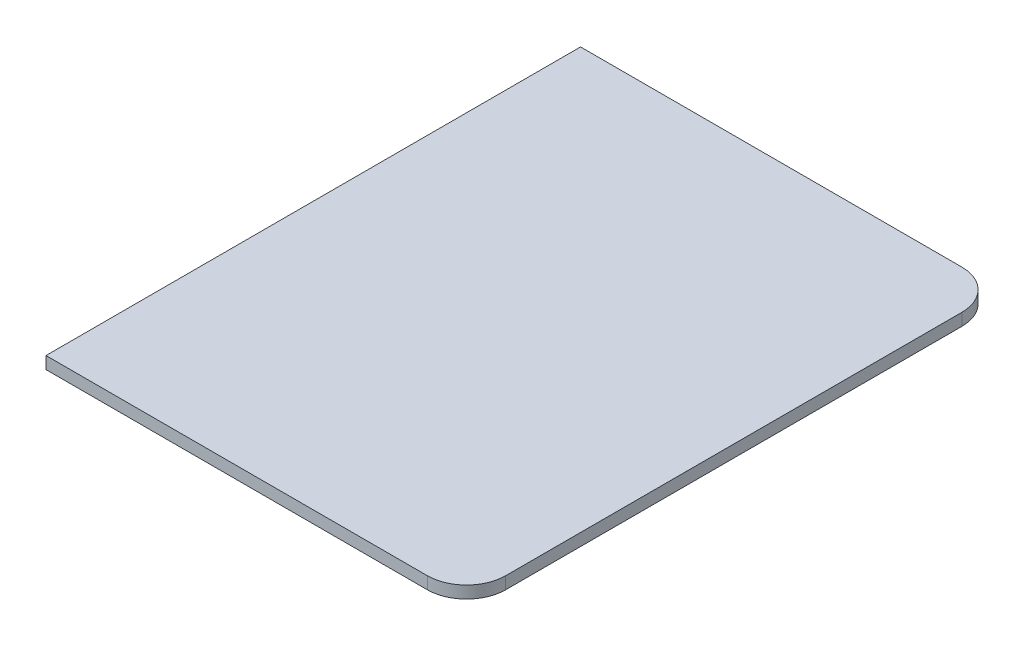
ISO-10303-21;
HEADER;
FILE_DESCRIPTION(('STEP AP214'),'2;1');
FILE_NAME('part.step','',(''),(''),'','','');
FILE_SCHEMA(('AUTOMOTIVE_DESIGN { 1 0 10303 214 1 1 1 1 }'));
ENDSEC;
DATA;
#1=APPLICATION_CONTEXT('core data for automotive mechanical design processes');
#2=APPLICATION_PROTOCOL_DEFINITION('international standard','automotive_design',2000,#1);
#3=PRODUCT_CONTEXT('',#1,'mechanical');
#4=PRODUCT('Part','Part','',(#3));
#5=PRODUCT_RELATED_PRODUCT_CATEGORY('part','',(#4));
#6=PRODUCT_DEFINITION_FORMATION('','',#4);
#7=PRODUCT_DEFINITION_CONTEXT('part definition',#1,'design');
#8=PRODUCT_DEFINITION('design','',#6,#7);
#9=PRODUCT_DEFINITION_SHAPE('','',#8);
#10=(LENGTH_UNIT() NAMED_UNIT(*) SI_UNIT(.MILLI.,.METRE.));
#11=(NAMED_UNIT(*) PLANE_ANGLE_UNIT() SI_UNIT($,.RADIAN.));
#12=(NAMED_UNIT(*) SI_UNIT($,.STERADIAN.) SOLID_ANGLE_UNIT());
#13=UNCERTAINTY_MEASURE_WITH_UNIT(LENGTH_MEASURE(1.E-05),#10,'distance_accuracy_value','');
#14=(GEOMETRIC_REPRESENTATION_CONTEXT(3) GLOBAL_UNCERTAINTY_ASSIGNED_CONTEXT((#13)) GLOBAL_UNIT_ASSIGNED_CONTEXT((#10,
#11,#12)) REPRESENTATION_CONTEXT('',''));
#15=CARTESIAN_POINT('',(0.,0.,0.));
#16=DIRECTION('',(0.,0.,1.));
#17=DIRECTION('',(1.,0.,0.));
#18=AXIS2_PLACEMENT_3D('',#15,#16,#17);
#19=CARTESIAN_POINT('',(-103.487400661469,99.2041428161141,-328.791357833779));
#20=DIRECTION('',(-1.,0.,0.));
#21=DIRECTION('',(0.,-1.,0.));
#22=AXIS2_PLACEMENT_3D('',#19,#20,#21);
#23=PLANE('',#22);
#24=DIRECTION('',(0.,0.,-1.));
#25=VECTOR('',#24,1.);
#26=CARTESIAN_POINT('',(-103.487400661469,97.7063535413109,-328.791357833779));
#27=LINE('',#26,#25);
#28=CARTESIAN_POINT('',(-103.487400661469,97.7063535413109,-328.791357833779));
#29=VERTEX_POINT('',#28);
#30=CARTESIAN_POINT('',(-103.487400661469,97.7063535413109,-394.415673074119));
#31=VERTEX_POINT('',#30);
#32=EDGE_CURVE('E100',#29,#31,#27,.T.);
#33=ORIENTED_EDGE('',*,*,#32,.F.);
#34=DIRECTION('',(0.,-1.,0.));
#35=VECTOR('',#34,1.);
#36=CARTESIAN_POINT('',(-103.487400661469,99.2041428161141,-328.791357833779));
#37=LINE('',#36,#35);
#38=CARTESIAN_POINT('',(-103.487400661469,99.2041428161141,-328.791357833779));
#39=VERTEX_POINT('',#38);
#40=EDGE_CURVE('E32',#39,#29,#37,.T.);
#41=ORIENTED_EDGE('',*,*,#40,.F.);
#42=DIRECTION('',(0.,0.,-1.));
#43=VECTOR('',#42,1.);
#44=CARTESIAN_POINT('',(-103.487400661469,99.2041428161141,-328.791357833779));
#45=LINE('',#44,#43);
#46=CARTESIAN_POINT('',(-103.487400661469,99.2041428161141,-394.415673074119));
#47=VERTEX_POINT('',#46);
#48=EDGE_CURVE('E114',#39,#47,#45,.T.);
#49=ORIENTED_EDGE('',*,*,#48,.T.);
#50=DIRECTION('',(0.,-1.,0.));
#51=VECTOR('',#50,1.);
#52=CARTESIAN_POINT('',(-103.487400661469,99.2041428161141,-394.415673074119));
#53=LINE('',#52,#51);
#54=EDGE_CURVE('E10',#47,#31,#53,.T.);
#55=ORIENTED_EDGE('',*,*,#54,.T.);
#56=EDGE_LOOP('',(#33,#41,#49,#55));
#57=FACE_BOUND('',#56,.T.);
#58=ADVANCED_FACE('F16',(#57),#23,.T.);
#59=CARTESIAN_POINT('',(-103.487400661469,99.2041428161141,-394.415673074119));
#60=DIRECTION('',(0.,0.,-1.));
#61=DIRECTION('',(-1.,0.,0.));
#62=AXIS2_PLACEMENT_3D('',#59,#60,#61);
#63=PLANE('',#62);
#64=DIRECTION('',(1.,0.,0.));
#65=VECTOR('',#64,1.);
#66=CARTESIAN_POINT('',(-103.487400661469,97.7063535413109,-394.415673074119));
#67=LINE('',#66,#65);
#68=CARTESIAN_POINT('',(-56.6752430412992,97.7063535413109,-394.415673074119));
#69=VERTEX_POINT('',#68);
#70=EDGE_CURVE('E103',#31,#69,#67,.T.);
#71=ORIENTED_EDGE('',*,*,#70,.F.);
#72=ORIENTED_EDGE('',*,*,#54,.F.);
#73=DIRECTION('',(1.,0.,0.));
#74=VECTOR('',#73,1.);
#75=CARTESIAN_POINT('',(-103.487400661469,99.2041428161141,-394.415673074119));
#76=LINE('',#75,#74);
#77=CARTESIAN_POINT('',(-56.6752430412992,99.2041428161141,-394.415673074119));
#78=VERTEX_POINT('',#77);
#79=EDGE_CURVE('E119',#47,#78,#76,.T.);
#80=ORIENTED_EDGE('',*,*,#79,.T.);
#81=DIRECTION('',(0.,-1.,0.));
#82=VECTOR('',#81,1.);
#83=CARTESIAN_POINT('',(-56.6752430412992,99.2041428161141,-394.415673074119));
#84=LINE('',#83,#82);
#85=EDGE_CURVE('E24',#78,#69,#84,.T.);
#86=ORIENTED_EDGE('',*,*,#85,.T.);
#87=EDGE_LOOP('',(#71,#72,#80,#86));
#88=FACE_BOUND('',#87,.T.);
#89=ADVANCED_FACE('F118',(#88),#63,.T.);
#90=CARTESIAN_POINT('',(-56.6752430412992,99.2041428161141,-389.603515453949));
#91=DIRECTION('',(0.,-1.,0.));
#92=DIRECTION('',(1.,0.,0.));
#93=AXIS2_PLACEMENT_3D('',#90,#91,#92);
#94=CYLINDRICAL_SURFACE('',#93,4.8121576201699);
#95=CARTESIAN_POINT('',(-56.6752430412992,97.7063535413109,-389.603515453949));
#96=DIRECTION('',(0.,-1.,0.));
#97=DIRECTION('',(0.,0.,-1.));
#98=AXIS2_PLACEMENT_3D('',#95,#96,#97);
#99=CIRCLE('',#98,4.8121576201699);
#100=CARTESIAN_POINT('',(-51.8630854211293,97.7063535413109,-389.603515453949));
#101=VERTEX_POINT('',#100);
#102=EDGE_CURVE('E106',#69,#101,#99,.T.);
#103=ORIENTED_EDGE('',*,*,#102,.F.);
#104=ORIENTED_EDGE('',*,*,#85,.F.);
#105=CARTESIAN_POINT('',(-56.6752430412992,99.2041428161141,-389.603515453949));
#106=DIRECTION('',(0.,-1.,0.));
#107=DIRECTION('',(0.,0.,-1.));
#108=AXIS2_PLACEMENT_3D('',#105,#106,#107);
#109=CIRCLE('',#108,4.8121576201699);
#110=CARTESIAN_POINT('',(-51.8630854211293,99.2041428161141,-389.603515453949));
#111=VERTEX_POINT('',#110);
#112=EDGE_CURVE('E91',#78,#111,#109,.T.);
#113=ORIENTED_EDGE('',*,*,#112,.T.);
#114=DIRECTION('',(0.,-1.,0.));
#115=VECTOR('',#114,1.);
#116=CARTESIAN_POINT('',(-51.8630854211293,99.2041428161141,-389.603515453949));
#117=LINE('',#116,#115);
#118=EDGE_CURVE('E83',#111,#101,#117,.T.);
#119=ORIENTED_EDGE('',*,*,#118,.T.);
#120=EDGE_LOOP('',(#103,#104,#113,#119));
#121=FACE_BOUND('',#120,.T.);
#122=ADVANCED_FACE('F121',(#121),#94,.T.);
#123=CARTESIAN_POINT('',(-51.8630854211293,99.2041428161141,-389.603515453949));
#124=DIRECTION('',(1.,0.,0.));
#125=DIRECTION('',(0.,0.,-1.));
#126=AXIS2_PLACEMENT_3D('',#123,#124,#125);
#127=PLANE('',#126);
#128=DIRECTION('',(0.,0.,1.));
#129=VECTOR('',#128,1.);
#130=CARTESIAN_POINT('',(-51.8630854211293,97.7063535413109,-389.603515453949));
#131=LINE('',#130,#129);
#132=CARTESIAN_POINT('',(-51.8630854211294,97.7063535413109,-333.603515453949));
#133=VERTEX_POINT('',#132);
#134=EDGE_CURVE('E109',#101,#133,#131,.T.);
#135=ORIENTED_EDGE('',*,*,#134,.F.);
#136=ORIENTED_EDGE('',*,*,#118,.F.);
#137=DIRECTION('',(0.,0.,1.));
#138=VECTOR('',#137,1.);
#139=CARTESIAN_POINT('',(-51.8630854211293,99.2041428161141,-389.603515453949));
#140=LINE('',#139,#138);
#141=CARTESIAN_POINT('',(-51.8630854211294,99.2041428161141,-333.603515453949));
#142=VERTEX_POINT('',#141);
#143=EDGE_CURVE('E86',#111,#142,#140,.T.);
#144=ORIENTED_EDGE('',*,*,#143,.T.);
#145=DIRECTION('',(0.,-1.,0.));
#146=VECTOR('',#145,1.);
#147=CARTESIAN_POINT('',(-51.8630854211294,99.2041428161141,-333.603515453949));
#148=LINE('',#147,#146);
#149=EDGE_CURVE('E72',#142,#133,#148,.T.);
#150=ORIENTED_EDGE('',*,*,#149,.T.);
#151=EDGE_LOOP('',(#135,#136,#144,#150));
#152=FACE_BOUND('',#151,.T.);
#153=ADVANCED_FACE('F87',(#152),#127,.T.);
#154=CARTESIAN_POINT('',(-56.6752430412993,99.2041428161141,-333.603515453949));
#155=DIRECTION('',(0.,-1.,0.));
#156=DIRECTION('',(1.,0.,0.));
#157=AXIS2_PLACEMENT_3D('',#154,#155,#156);
#158=CYLINDRICAL_SURFACE('',#157,4.81215762016989);
#159=CARTESIAN_POINT('',(-56.6752430412993,97.7063535413109,-333.603515453949));
#160=DIRECTION('',(0.,-1.,0.));
#161=DIRECTION('',(1.,0.,0.));
#162=AXIS2_PLACEMENT_3D('',#159,#160,#161);
#163=CIRCLE('',#162,4.81215762016989);
#164=CARTESIAN_POINT('',(-56.6752430412993,97.7063535413109,-328.791357833779));
#165=VERTEX_POINT('',#164);
#166=EDGE_CURVE('E79',#133,#165,#163,.T.);
#167=ORIENTED_EDGE('',*,*,#166,.F.);
#168=ORIENTED_EDGE('',*,*,#149,.F.);
#169=CARTESIAN_POINT('',(-56.6752430412993,99.2041428161141,-333.603515453949));
#170=DIRECTION('',(0.,-1.,0.));
#171=DIRECTION('',(1.,0.,0.));
#172=AXIS2_PLACEMENT_3D('',#169,#170,#171);
#173=CIRCLE('',#172,4.81215762016989);
#174=CARTESIAN_POINT('',(-56.6752430412993,99.2041428161141,-328.791357833779));
#175=VERTEX_POINT('',#174);
#176=EDGE_CURVE('E76',#142,#175,#173,.T.);
#177=ORIENTED_EDGE('',*,*,#176,.T.);
#178=DIRECTION('',(0.,-1.,0.));
#179=VECTOR('',#178,1.);
#180=CARTESIAN_POINT('',(-56.6752430412993,99.2041428161141,-328.791357833779));
#181=LINE('',#180,#179);
#182=EDGE_CURVE('E54',#175,#165,#181,.T.);
#183=ORIENTED_EDGE('',*,*,#182,.T.);
#184=EDGE_LOOP('',(#167,#168,#177,#183));
#185=FACE_BOUND('',#184,.T.);
#186=ADVANCED_FACE('F74',(#185),#158,.T.);
#187=CARTESIAN_POINT('',(-56.6752430412993,99.2041428161141,-328.791357833779));
#188=DIRECTION('',(0.,0.,1.));
#189=DIRECTION('',(1.,0.,0.));
#190=AXIS2_PLACEMENT_3D('',#187,#188,#189);
#191=PLANE('',#190);
#192=DIRECTION('',(-1.,0.,0.));
#193=VECTOR('',#192,1.);
#194=CARTESIAN_POINT('',(-56.6752430412993,97.7063535413109,-328.791357833779));
#195=LINE('',#194,#193);
#196=EDGE_CURVE('E112',#165,#29,#195,.T.);
#197=ORIENTED_EDGE('',*,*,#196,.F.);
#198=ORIENTED_EDGE('',*,*,#182,.F.);
#199=DIRECTION('',(-1.,0.,0.));
#200=VECTOR('',#199,1.);
#201=CARTESIAN_POINT('',(-56.6752430412993,99.2041428161141,-328.791357833779));
#202=LINE('',#201,#200);
#203=EDGE_CURVE('E95',#175,#39,#202,.T.);
#204=ORIENTED_EDGE('',*,*,#203,.T.);
#205=ORIENTED_EDGE('',*,*,#40,.T.);
#206=EDGE_LOOP('',(#197,#198,#204,#205));
#207=FACE_BOUND('',#206,.T.);
#208=ADVANCED_FACE('F140',(#207),#191,.T.);
#209=CARTESIAN_POINT('',(-52.6752430412992,99.2041428161141,-361.603515453949));
#210=DIRECTION('',(0.,-1.,0.));
#211=DIRECTION('',(1.,0.,0.));
#212=AXIS2_PLACEMENT_3D('',#209,#210,#211);
#213=PLANE('',#212);
#214=ORIENTED_EDGE('',*,*,#48,.F.);
#215=ORIENTED_EDGE('',*,*,#203,.F.);
#216=ORIENTED_EDGE('',*,*,#176,.F.);
#217=ORIENTED_EDGE('',*,*,#143,.F.);
#218=ORIENTED_EDGE('',*,*,#112,.F.);
#219=ORIENTED_EDGE('',*,*,#79,.F.);
#220=EDGE_LOOP('',(#214,#215,#216,#217,#218,#219));
#221=FACE_BOUND('',#220,.T.);
#222=ADVANCED_FACE('F94',(#221),#213,.F.);
#223=CARTESIAN_POINT('',(-52.6752430412992,97.7063535413109,-361.603515453949));
#224=DIRECTION('',(0.,-1.,0.));
#225=DIRECTION('',(1.,0.,0.));
#226=AXIS2_PLACEMENT_3D('',#223,#224,#225);
#227=PLANE('',#226);
#228=ORIENTED_EDGE('',*,*,#32,.T.);
#229=ORIENTED_EDGE('',*,*,#70,.T.);
#230=ORIENTED_EDGE('',*,*,#102,.T.);
#231=ORIENTED_EDGE('',*,*,#134,.T.);
#232=ORIENTED_EDGE('',*,*,#166,.T.);
#233=ORIENTED_EDGE('',*,*,#196,.T.);
#234=EDGE_LOOP('',(#228,#229,#230,#231,#232,#233));
#235=FACE_BOUND('',#234,.T.);
#236=ADVANCED_FACE('F123',(#235),#227,.T.);
#237=CLOSED_SHELL('',(#58,#89,#122,#153,#186,#208,#222,#236));
#238=MANIFOLD_SOLID_BREP('B1',#237);
#239=ADVANCED_BREP_SHAPE_REPRESENTATION('',(#18,#238),#14);
#240=SHAPE_DEFINITION_REPRESENTATION(#9,#239);
ENDSEC;
END-ISO-10303-21;
